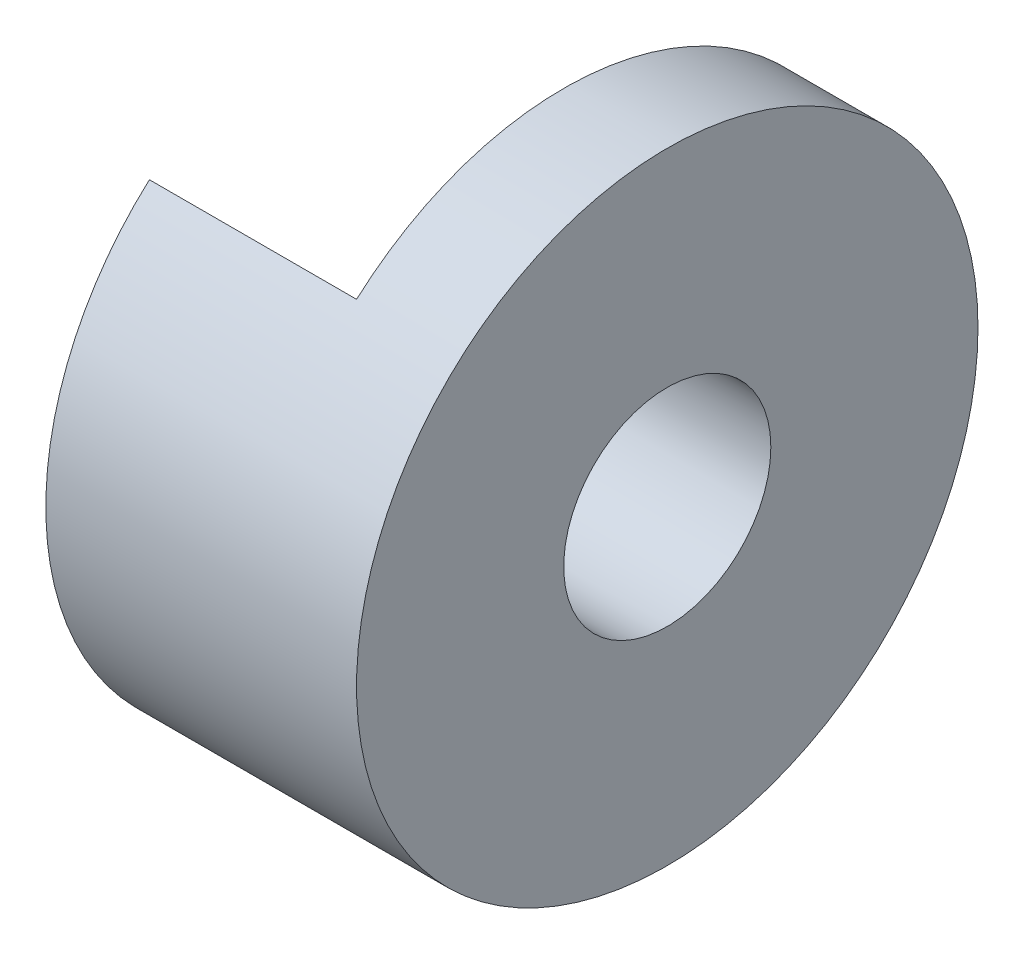
ISO-10303-21;
HEADER;
FILE_DESCRIPTION(('STEP AP214'),'2;1');
FILE_NAME('part.step','',(''),(''),'','','');
FILE_SCHEMA(('AUTOMOTIVE_DESIGN { 1 0 10303 214 1 1 1 1 }'));
ENDSEC;
DATA;
#1=APPLICATION_CONTEXT('core data for automotive mechanical design processes');
#2=APPLICATION_PROTOCOL_DEFINITION('international standard','automotive_design',2000,#1);
#3=PRODUCT_CONTEXT('',#1,'mechanical');
#4=PRODUCT('Part','Part','',(#3));
#5=PRODUCT_RELATED_PRODUCT_CATEGORY('part','',(#4));
#6=PRODUCT_DEFINITION_FORMATION('','',#4);
#7=PRODUCT_DEFINITION_CONTEXT('part definition',#1,'design');
#8=PRODUCT_DEFINITION('design','',#6,#7);
#9=PRODUCT_DEFINITION_SHAPE('','',#8);
#10=(LENGTH_UNIT() NAMED_UNIT(*) SI_UNIT(.MILLI.,.METRE.));
#11=(NAMED_UNIT(*) PLANE_ANGLE_UNIT() SI_UNIT($,.RADIAN.));
#12=(NAMED_UNIT(*) SI_UNIT($,.STERADIAN.) SOLID_ANGLE_UNIT());
#13=UNCERTAINTY_MEASURE_WITH_UNIT(LENGTH_MEASURE(1.E-05),#10,'distance_accuracy_value','');
#14=(GEOMETRIC_REPRESENTATION_CONTEXT(3) GLOBAL_UNCERTAINTY_ASSIGNED_CONTEXT((#13)) GLOBAL_UNIT_ASSIGNED_CONTEXT((#10,
#11,#12)) REPRESENTATION_CONTEXT('',''));
#15=CARTESIAN_POINT('',(0.,0.,0.));
#16=DIRECTION('',(0.,0.,1.));
#17=DIRECTION('',(1.,0.,0.));
#18=AXIS2_PLACEMENT_3D('',#15,#16,#17);
#19=CARTESIAN_POINT('',(-1.5,0.,0.));
#20=DIRECTION('',(1.,0.,0.));
#21=DIRECTION('',(0.,0.,-1.));
#22=AXIS2_PLACEMENT_3D('',#19,#20,#21);
#23=PLANE('',#22);
#24=DIRECTION('',(0.,0.,-1.));
#25=VECTOR('',#24,1.);
#26=CARTESIAN_POINT('',(-1.5,0.,0.));
#27=LINE('',#26,#25);
#28=CARTESIAN_POINT('',(-1.5,0.,-1.));
#29=VERTEX_POINT('',#28);
#30=CARTESIAN_POINT('',(-1.5,0.,-3.));
#31=VERTEX_POINT('',#30);
#32=EDGE_CURVE('E133',#29,#31,#27,.T.);
#33=ORIENTED_EDGE('',*,*,#32,.T.);
#34=CARTESIAN_POINT('',(-1.5,0.,0.));
#35=DIRECTION('',(1.,0.,0.));
#36=DIRECTION('',(0.,0.,-1.));
#37=AXIS2_PLACEMENT_3D('',#34,#35,#36);
#38=CIRCLE('',#37,3.);
#39=CARTESIAN_POINT('',(-1.5,-3.,0.));
#40=VERTEX_POINT('',#39);
#41=EDGE_CURVE('E37',#40,#31,#38,.T.);
#42=ORIENTED_EDGE('',*,*,#41,.F.);
#43=DIRECTION('',(0.,-1.,0.));
#44=VECTOR('',#43,1.);
#45=CARTESIAN_POINT('',(-1.5,0.,0.));
#46=LINE('',#45,#44);
#47=CARTESIAN_POINT('',(-1.5,-1.,0.));
#48=VERTEX_POINT('',#47);
#49=EDGE_CURVE('E131',#48,#40,#46,.T.);
#50=ORIENTED_EDGE('',*,*,#49,.F.);
#51=CARTESIAN_POINT('',(-1.5,0.,0.));
#52=DIRECTION('',(1.,0.,0.));
#53=DIRECTION('',(0.,0.,-1.));
#54=AXIS2_PLACEMENT_3D('',#51,#52,#53);
#55=CIRCLE('',#54,1.);
#56=EDGE_CURVE('E123',#48,#29,#55,.T.);
#57=ORIENTED_EDGE('',*,*,#56,.T.);
#58=EDGE_LOOP('',(#33,#42,#50,#57));
#59=FACE_BOUND('',#58,.T.);
#60=ADVANCED_FACE('F33',(#59),#23,.F.);
#61=DIRECTION('',(0.,-1.,0.));
#62=VECTOR('',#61,1.);
#63=CARTESIAN_POINT('',(-1.5,0.,2.));
#64=LINE('',#63,#62);
#65=CARTESIAN_POINT('',(-1.5,2.23606797749979,2.));
#66=VERTEX_POINT('',#65);
#67=CARTESIAN_POINT('',(-1.5,-2.23606797749979,2.));
#68=VERTEX_POINT('',#67);
#69=EDGE_CURVE('E129',#66,#68,#64,.T.);
#70=ORIENTED_EDGE('',*,*,#69,.T.);
#71=EDGE_CURVE('E42',#66,#68,#38,.T.);
#72=ORIENTED_EDGE('',*,*,#71,.F.);
#73=EDGE_LOOP('',(#70,#72));
#74=FACE_BOUND('',#73,.T.);
#75=ADVANCED_FACE('F146',(#74),#23,.F.);
#76=CARTESIAN_POINT('',(1.5,0.,0.));
#77=DIRECTION('',(-1.,0.,0.));
#78=DIRECTION('',(0.,0.,1.));
#79=AXIS2_PLACEMENT_3D('',#76,#77,#78);
#80=CYLINDRICAL_SURFACE('',#79,3.);
#81=CARTESIAN_POINT('',(1.5,0.,0.));
#82=DIRECTION('',(1.,0.,0.));
#83=DIRECTION('',(0.,0.,-1.));
#84=AXIS2_PLACEMENT_3D('',#81,#82,#83);
#85=CIRCLE('',#84,3.);
#86=CARTESIAN_POINT('',(1.5,0.,-3.));
#87=VERTEX_POINT('',#86);
#88=EDGE_CURVE('E11',#87,#87,#85,.T.);
#89=ORIENTED_EDGE('',*,*,#88,.F.);
#90=EDGE_LOOP('',(#89));
#91=FACE_BOUND('',#90,.T.);
#92=DIRECTION('',(-1.,0.,0.));
#93=VECTOR('',#92,1.);
#94=CARTESIAN_POINT('',(0.5,0.,-3.));
#95=LINE('',#94,#93);
#96=CARTESIAN_POINT('',(0.5,0.,-3.));
#97=VERTEX_POINT('',#96);
#98=EDGE_CURVE('E77',#97,#31,#95,.T.);
#99=ORIENTED_EDGE('',*,*,#98,.F.);
#100=CARTESIAN_POINT('',(0.5,0.,0.));
#101=DIRECTION('',(-1.,0.,0.));
#102=DIRECTION('',(0.,0.,1.));
#103=AXIS2_PLACEMENT_3D('',#100,#101,#102);
#104=CIRCLE('',#103,3.);
#105=CARTESIAN_POINT('',(0.5,2.23606797749979,2.));
#106=VERTEX_POINT('',#105);
#107=EDGE_CURVE('E99',#106,#97,#104,.T.);
#108=ORIENTED_EDGE('',*,*,#107,.F.);
#109=DIRECTION('',(-1.,0.,0.));
#110=VECTOR('',#109,1.);
#111=CARTESIAN_POINT('',(0.5,2.23606797749979,2.));
#112=LINE('',#111,#110);
#113=EDGE_CURVE('E97',#106,#66,#112,.T.);
#114=ORIENTED_EDGE('',*,*,#113,.T.);
#115=ORIENTED_EDGE('',*,*,#71,.T.);
#116=DIRECTION('',(-1.,0.,0.));
#117=VECTOR('',#116,1.);
#118=CARTESIAN_POINT('',(0.5,-2.23606797749979,2.));
#119=LINE('',#118,#117);
#120=CARTESIAN_POINT('',(0.5,-2.23606797749979,2.));
#121=VERTEX_POINT('',#120);
#122=EDGE_CURVE('E94',#121,#68,#119,.T.);
#123=ORIENTED_EDGE('',*,*,#122,.F.);
#124=CARTESIAN_POINT('',(0.5,-3.,0.));
#125=VERTEX_POINT('',#124);
#126=EDGE_CURVE('E100',#125,#121,#104,.T.);
#127=ORIENTED_EDGE('',*,*,#126,.F.);
#128=DIRECTION('',(-1.,0.,0.));
#129=VECTOR('',#128,1.);
#130=CARTESIAN_POINT('',(0.5,-3.,0.));
#131=LINE('',#130,#129);
#132=EDGE_CURVE('E109',#125,#40,#131,.T.);
#133=ORIENTED_EDGE('',*,*,#132,.T.);
#134=ORIENTED_EDGE('',*,*,#41,.T.);
#135=EDGE_LOOP('',(#99,#108,#114,#115,#123,#127,#133,#134));
#136=FACE_BOUND('',#135,.T.);
#137=ADVANCED_FACE('F35',(#91,#136),#80,.T.);
#138=CARTESIAN_POINT('',(1.5,0.,0.));
#139=DIRECTION('',(-1.,0.,0.));
#140=DIRECTION('',(0.,0.,1.));
#141=AXIS2_PLACEMENT_3D('',#138,#139,#140);
#142=CYLINDRICAL_SURFACE('',#141,1.);
#143=CARTESIAN_POINT('',(1.5,0.,0.));
#144=DIRECTION('',(1.,0.,0.));
#145=DIRECTION('',(0.,0.,-1.));
#146=AXIS2_PLACEMENT_3D('',#143,#144,#145);
#147=CIRCLE('',#146,1.);
#148=CARTESIAN_POINT('',(1.5,0.,-1.));
#149=VERTEX_POINT('',#148);
#150=EDGE_CURVE('E120',#149,#149,#147,.T.);
#151=ORIENTED_EDGE('',*,*,#150,.T.);
#152=EDGE_LOOP('',(#151));
#153=FACE_BOUND('',#152,.T.);
#154=CARTESIAN_POINT('',(0.5,0.,0.));
#155=DIRECTION('',(-1.,0.,0.));
#156=DIRECTION('',(0.,0.,1.));
#157=AXIS2_PLACEMENT_3D('',#154,#155,#156);
#158=CIRCLE('',#157,1.);
#159=CARTESIAN_POINT('',(0.5,0.,-1.));
#160=VERTEX_POINT('',#159);
#161=CARTESIAN_POINT('',(0.5,-1.,0.));
#162=VERTEX_POINT('',#161);
#163=EDGE_CURVE('E136',#160,#162,#158,.F.);
#164=ORIENTED_EDGE('',*,*,#163,.F.);
#165=DIRECTION('',(-1.,0.,0.));
#166=VECTOR('',#165,1.);
#167=CARTESIAN_POINT('',(0.5,0.,-1.));
#168=LINE('',#167,#166);
#169=EDGE_CURVE('E117',#160,#29,#168,.T.);
#170=ORIENTED_EDGE('',*,*,#169,.T.);
#171=ORIENTED_EDGE('',*,*,#56,.F.);
#172=DIRECTION('',(-1.,0.,0.));
#173=VECTOR('',#172,1.);
#174=CARTESIAN_POINT('',(0.5,-1.,0.));
#175=LINE('',#174,#173);
#176=EDGE_CURVE('E112',#162,#48,#175,.T.);
#177=ORIENTED_EDGE('',*,*,#176,.F.);
#178=EDGE_LOOP('',(#164,#170,#171,#177));
#179=FACE_BOUND('',#178,.T.);
#180=ADVANCED_FACE('F141',(#153,#179),#142,.F.);
#181=CARTESIAN_POINT('',(1.5,0.,0.));
#182=DIRECTION('',(1.,0.,0.));
#183=DIRECTION('',(0.,0.,-1.));
#184=AXIS2_PLACEMENT_3D('',#181,#182,#183);
#185=PLANE('',#184);
#186=ORIENTED_EDGE('',*,*,#88,.T.);
#187=EDGE_LOOP('',(#186));
#188=FACE_BOUND('',#187,.T.);
#189=ORIENTED_EDGE('',*,*,#150,.F.);
#190=EDGE_LOOP('',(#189));
#191=FACE_BOUND('',#190,.T.);
#192=ADVANCED_FACE('F154',(#188,#191),#185,.T.);
#193=CARTESIAN_POINT('',(0.5,0.,0.));
#194=DIRECTION('',(0.,1.,0.));
#195=DIRECTION('',(0.,0.,1.));
#196=AXIS2_PLACEMENT_3D('',#193,#194,#195);
#197=PLANE('',#196);
#198=ORIENTED_EDGE('',*,*,#32,.F.);
#199=ORIENTED_EDGE('',*,*,#169,.F.);
#200=DIRECTION('',(0.,0.,-1.));
#201=VECTOR('',#200,1.);
#202=CARTESIAN_POINT('',(0.5,0.,0.));
#203=LINE('',#202,#201);
#204=EDGE_CURVE('E49',#160,#97,#203,.T.);
#205=ORIENTED_EDGE('',*,*,#204,.T.);
#206=ORIENTED_EDGE('',*,*,#98,.T.);
#207=EDGE_LOOP('',(#198,#199,#205,#206));
#208=FACE_BOUND('',#207,.T.);
#209=ADVANCED_FACE('F157',(#208),#197,.T.);
#210=CARTESIAN_POINT('',(0.5,0.,2.));
#211=DIRECTION('',(0.,0.,-1.));
#212=DIRECTION('',(-1.,0.,0.));
#213=AXIS2_PLACEMENT_3D('',#210,#211,#212);
#214=PLANE('',#213);
#215=ORIENTED_EDGE('',*,*,#69,.F.);
#216=ORIENTED_EDGE('',*,*,#113,.F.);
#217=DIRECTION('',(0.,-1.,0.));
#218=VECTOR('',#217,1.);
#219=CARTESIAN_POINT('',(0.5,0.,2.));
#220=LINE('',#219,#218);
#221=EDGE_CURVE('E90',#106,#121,#220,.T.);
#222=ORIENTED_EDGE('',*,*,#221,.T.);
#223=ORIENTED_EDGE('',*,*,#122,.T.);
#224=EDGE_LOOP('',(#215,#216,#222,#223));
#225=FACE_BOUND('',#224,.T.);
#226=ADVANCED_FACE('F92',(#225),#214,.T.);
#227=CARTESIAN_POINT('',(0.5,0.,0.));
#228=DIRECTION('',(0.,0.,-1.));
#229=DIRECTION('',(0.,1.,0.));
#230=AXIS2_PLACEMENT_3D('',#227,#228,#229);
#231=PLANE('',#230);
#232=ORIENTED_EDGE('',*,*,#49,.T.);
#233=ORIENTED_EDGE('',*,*,#132,.F.);
#234=DIRECTION('',(0.,-1.,0.));
#235=VECTOR('',#234,1.);
#236=CARTESIAN_POINT('',(0.5,0.,0.));
#237=LINE('',#236,#235);
#238=EDGE_CURVE('E85',#162,#125,#237,.T.);
#239=ORIENTED_EDGE('',*,*,#238,.F.);
#240=ORIENTED_EDGE('',*,*,#176,.T.);
#241=EDGE_LOOP('',(#232,#233,#239,#240));
#242=FACE_BOUND('',#241,.T.);
#243=ADVANCED_FACE('F142',(#242),#231,.F.);
#244=CARTESIAN_POINT('',(0.5,0.,0.));
#245=DIRECTION('',(-1.,0.,0.));
#246=DIRECTION('',(0.,0.,1.));
#247=AXIS2_PLACEMENT_3D('',#244,#245,#246);
#248=PLANE('',#247);
#249=ORIENTED_EDGE('',*,*,#204,.F.);
#250=ORIENTED_EDGE('',*,*,#163,.T.);
#251=ORIENTED_EDGE('',*,*,#238,.T.);
#252=ORIENTED_EDGE('',*,*,#126,.T.);
#253=ORIENTED_EDGE('',*,*,#221,.F.);
#254=ORIENTED_EDGE('',*,*,#107,.T.);
#255=EDGE_LOOP('',(#249,#250,#251,#252,#253,#254));
#256=FACE_BOUND('',#255,.T.);
#257=ADVANCED_FACE('F103',(#256),#248,.T.);
#258=CLOSED_SHELL('',(#60,#75,#137,#180,#192,#209,#226,#243,#257));
#259=MANIFOLD_SOLID_BREP('B2',#258);
#260=ADVANCED_BREP_SHAPE_REPRESENTATION('',(#18,#259),#14);
#261=SHAPE_DEFINITION_REPRESENTATION(#9,#260);
ENDSEC;
END-ISO-10303-21;
